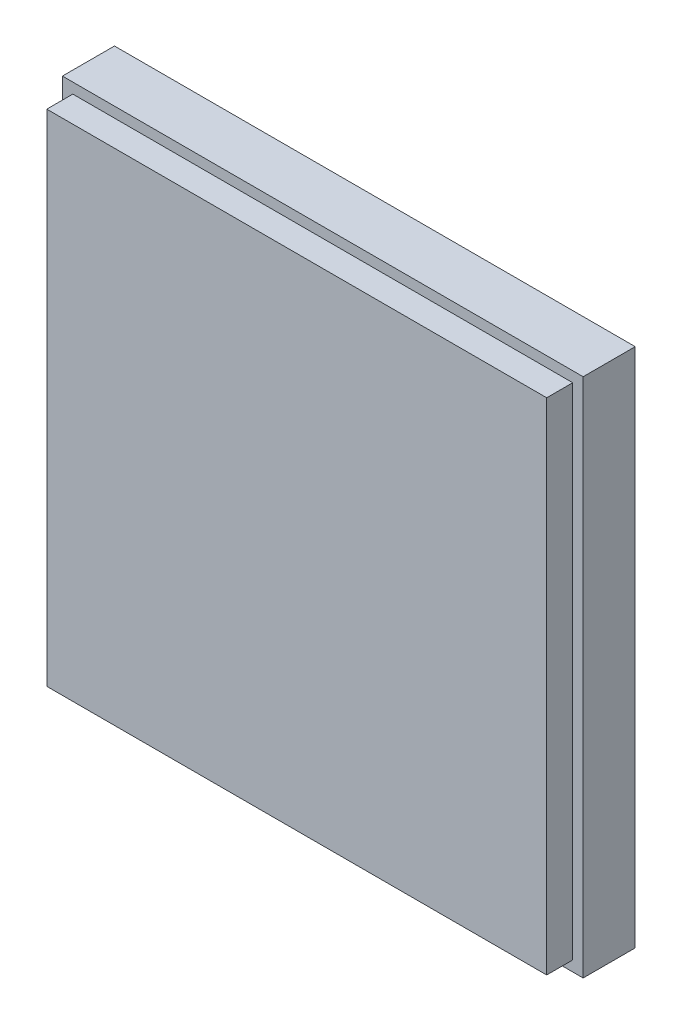
ISO-10303-21;
HEADER;
FILE_DESCRIPTION(('STEP AP214'),'2;1');
FILE_NAME('part.step','',(''),(''),'','','');
FILE_SCHEMA(('AUTOMOTIVE_DESIGN { 1 0 10303 214 1 1 1 1 }'));
ENDSEC;
DATA;
#1=APPLICATION_CONTEXT('core data for automotive mechanical design processes');
#2=APPLICATION_PROTOCOL_DEFINITION('international standard','automotive_design',2000,#1);
#3=PRODUCT_CONTEXT('',#1,'mechanical');
#4=PRODUCT('Part','Part','',(#3));
#5=PRODUCT_RELATED_PRODUCT_CATEGORY('part','',(#4));
#6=PRODUCT_DEFINITION_FORMATION('','',#4);
#7=PRODUCT_DEFINITION_CONTEXT('part definition',#1,'design');
#8=PRODUCT_DEFINITION('design','',#6,#7);
#9=PRODUCT_DEFINITION_SHAPE('','',#8);
#10=(LENGTH_UNIT() NAMED_UNIT(*) SI_UNIT(.MILLI.,.METRE.));
#11=(NAMED_UNIT(*) PLANE_ANGLE_UNIT() SI_UNIT($,.RADIAN.));
#12=(NAMED_UNIT(*) SI_UNIT($,.STERADIAN.) SOLID_ANGLE_UNIT());
#13=UNCERTAINTY_MEASURE_WITH_UNIT(LENGTH_MEASURE(1.E-05),#10,'distance_accuracy_value','');
#14=(GEOMETRIC_REPRESENTATION_CONTEXT(3) GLOBAL_UNCERTAINTY_ASSIGNED_CONTEXT((#13)) GLOBAL_UNIT_ASSIGNED_CONTEXT((#10,
#11,#12)) REPRESENTATION_CONTEXT('',''));
#15=CARTESIAN_POINT('',(0.,0.,0.));
#16=DIRECTION('',(0.,0.,1.));
#17=DIRECTION('',(1.,0.,0.));
#18=AXIS2_PLACEMENT_3D('',#15,#16,#17);
#19=CARTESIAN_POINT('',(-66.0255059306814,18.5238786074807,10.));
#20=DIRECTION('',(1.,0.,0.));
#21=DIRECTION('',(0.,0.,-1.));
#22=AXIS2_PLACEMENT_3D('',#19,#20,#21);
#23=PLANE('',#22);
#24=DIRECTION('',(0.,-1.,0.));
#25=VECTOR('',#24,1.);
#26=CARTESIAN_POINT('',(-66.0255059306814,18.5238786074807,0.));
#27=LINE('',#26,#25);
#28=CARTESIAN_POINT('',(-66.0255059306814,18.5238786074807,0.));
#29=VERTEX_POINT('',#28);
#30=CARTESIAN_POINT('',(-66.0255059306814,-81.4761213925193,0.));
#31=VERTEX_POINT('',#30);
#32=EDGE_CURVE('E118',#29,#31,#27,.T.);
#33=ORIENTED_EDGE('',*,*,#32,.T.);
#34=DIRECTION('',(0.,0.,-1.));
#35=VECTOR('',#34,1.);
#36=CARTESIAN_POINT('',(-66.0255059306814,-81.4761213925193,10.));
#37=LINE('',#36,#35);
#38=CARTESIAN_POINT('',(-66.0255059306814,-81.4761213925193,10.));
#39=VERTEX_POINT('',#38);
#40=EDGE_CURVE('E11',#39,#31,#37,.T.);
#41=ORIENTED_EDGE('',*,*,#40,.F.);
#42=DIRECTION('',(0.,-1.,0.));
#43=VECTOR('',#42,1.);
#44=CARTESIAN_POINT('',(-66.0255059306814,18.5238786074807,10.));
#45=LINE('',#44,#43);
#46=CARTESIAN_POINT('',(-66.0255059306814,18.5238786074807,10.));
#47=VERTEX_POINT('',#46);
#48=EDGE_CURVE('E127',#47,#39,#45,.T.);
#49=ORIENTED_EDGE('',*,*,#48,.F.);
#50=DIRECTION('',(0.,0.,-1.));
#51=VECTOR('',#50,1.);
#52=CARTESIAN_POINT('',(-66.0255059306814,18.5238786074807,10.));
#53=LINE('',#52,#51);
#54=EDGE_CURVE('E136',#47,#29,#53,.T.);
#55=ORIENTED_EDGE('',*,*,#54,.T.);
#56=EDGE_LOOP('',(#33,#41,#49,#55));
#57=FACE_BOUND('',#56,.T.);
#58=ADVANCED_FACE('F33',(#57),#23,.F.);
#59=CARTESIAN_POINT('',(-66.0255059306814,-81.4761213925193,10.));
#60=DIRECTION('',(0.,1.,0.));
#61=DIRECTION('',(0.,0.,1.));
#62=AXIS2_PLACEMENT_3D('',#59,#60,#61);
#63=PLANE('',#62);
#64=DIRECTION('',(1.,0.,0.));
#65=VECTOR('',#64,1.);
#66=CARTESIAN_POINT('',(-66.0255059306814,-81.4761213925193,0.));
#67=LINE('',#66,#65);
#68=CARTESIAN_POINT('',(33.9744940693186,-81.4761213925193,0.));
#69=VERTEX_POINT('',#68);
#70=EDGE_CURVE('E121',#31,#69,#67,.T.);
#71=ORIENTED_EDGE('',*,*,#70,.T.);
#72=DIRECTION('',(0.,0.,-1.));
#73=VECTOR('',#72,1.);
#74=CARTESIAN_POINT('',(33.9744940693186,-81.4761213925193,10.));
#75=LINE('',#74,#73);
#76=CARTESIAN_POINT('',(33.9744940693186,-81.4761213925193,10.));
#77=VERTEX_POINT('',#76);
#78=EDGE_CURVE('E40',#77,#69,#75,.T.);
#79=ORIENTED_EDGE('',*,*,#78,.F.);
#80=DIRECTION('',(1.,0.,0.));
#81=VECTOR('',#80,1.);
#82=CARTESIAN_POINT('',(-66.0255059306814,-81.4761213925193,10.));
#83=LINE('',#82,#81);
#84=EDGE_CURVE('E130',#39,#77,#83,.T.);
#85=ORIENTED_EDGE('',*,*,#84,.F.);
#86=ORIENTED_EDGE('',*,*,#40,.T.);
#87=EDGE_LOOP('',(#71,#79,#85,#86));
#88=FACE_BOUND('',#87,.T.);
#89=ADVANCED_FACE('F167',(#88),#63,.F.);
#90=CARTESIAN_POINT('',(33.9744940693186,18.5238786074807,10.));
#91=DIRECTION('',(-1.,0.,0.));
#92=DIRECTION('',(0.,-1.,0.));
#93=AXIS2_PLACEMENT_3D('',#90,#91,#92);
#94=PLANE('',#93);
#95=DIRECTION('',(0.,1.,0.));
#96=VECTOR('',#95,1.);
#97=CARTESIAN_POINT('',(33.9744940693186,18.5238786074807,0.));
#98=LINE('',#97,#96);
#99=CARTESIAN_POINT('',(33.9744940693186,18.5238786074807,0.));
#100=VERTEX_POINT('',#99);
#101=EDGE_CURVE('E139',#69,#100,#98,.T.);
#102=ORIENTED_EDGE('',*,*,#101,.T.);
#103=DIRECTION('',(0.,0.,-1.));
#104=VECTOR('',#103,1.);
#105=CARTESIAN_POINT('',(33.9744940693186,18.5238786074807,10.));
#106=LINE('',#105,#104);
#107=CARTESIAN_POINT('',(33.9744940693186,18.5238786074807,10.));
#108=VERTEX_POINT('',#107);
#109=EDGE_CURVE('E144',#108,#100,#106,.T.);
#110=ORIENTED_EDGE('',*,*,#109,.F.);
#111=DIRECTION('',(0.,1.,0.));
#112=VECTOR('',#111,1.);
#113=CARTESIAN_POINT('',(33.9744940693186,18.5238786074807,10.));
#114=LINE('',#113,#112);
#115=EDGE_CURVE('E133',#77,#108,#114,.T.);
#116=ORIENTED_EDGE('',*,*,#115,.F.);
#117=ORIENTED_EDGE('',*,*,#78,.T.);
#118=EDGE_LOOP('',(#102,#110,#116,#117));
#119=FACE_BOUND('',#118,.T.);
#120=ADVANCED_FACE('F151',(#119),#94,.F.);
#121=CARTESIAN_POINT('',(-66.0255059306814,18.5238786074807,10.));
#122=DIRECTION('',(0.,-1.,0.));
#123=DIRECTION('',(0.,0.,-1.));
#124=AXIS2_PLACEMENT_3D('',#121,#122,#123);
#125=PLANE('',#124);
#126=DIRECTION('',(-1.,0.,0.));
#127=VECTOR('',#126,1.);
#128=CARTESIAN_POINT('',(-66.0255059306814,18.5238786074807,0.));
#129=LINE('',#128,#127);
#130=EDGE_CURVE('E131',#100,#29,#129,.T.);
#131=ORIENTED_EDGE('',*,*,#130,.T.);
#132=ORIENTED_EDGE('',*,*,#54,.F.);
#133=DIRECTION('',(-1.,0.,0.));
#134=VECTOR('',#133,1.);
#135=CARTESIAN_POINT('',(-66.0255059306814,18.5238786074807,10.));
#136=LINE('',#135,#134);
#137=EDGE_CURVE('E135',#108,#47,#136,.T.);
#138=ORIENTED_EDGE('',*,*,#137,.F.);
#139=ORIENTED_EDGE('',*,*,#109,.T.);
#140=EDGE_LOOP('',(#131,#132,#138,#139));
#141=FACE_BOUND('',#140,.T.);
#142=ADVANCED_FACE('F160',(#141),#125,.F.);
#143=CARTESIAN_POINT('',(0.,0.,10.));
#144=DIRECTION('',(0.,0.,1.));
#145=DIRECTION('',(1.,0.,0.));
#146=AXIS2_PLACEMENT_3D('',#143,#144,#145);
#147=PLANE('',#146);
#148=DIRECTION('',(0.,-1.,0.));
#149=VECTOR('',#148,1.);
#150=CARTESIAN_POINT('',(-64.0255059306814,16.5238786074807,10.));
#151=LINE('',#150,#149);
#152=CARTESIAN_POINT('',(-64.0255059306814,16.5238786074807,10.));
#153=VERTEX_POINT('',#152);
#154=CARTESIAN_POINT('',(-64.0255059306814,-79.4761213925193,10.));
#155=VERTEX_POINT('',#154);
#156=EDGE_CURVE('E47',#153,#155,#151,.T.);
#157=ORIENTED_EDGE('',*,*,#156,.F.);
#158=DIRECTION('',(1.,0.,0.));
#159=VECTOR('',#158,1.);
#160=CARTESIAN_POINT('',(-64.0255059306814,16.5238786074807,10.));
#161=LINE('',#160,#159);
#162=CARTESIAN_POINT('',(31.9744940693186,16.5238786074807,10.));
#163=VERTEX_POINT('',#162);
#164=EDGE_CURVE('E52',#153,#163,#161,.T.);
#165=ORIENTED_EDGE('',*,*,#164,.T.);
#166=DIRECTION('',(0.,-1.,0.));
#167=VECTOR('',#166,1.);
#168=CARTESIAN_POINT('',(31.9744940693186,16.5238786074807,10.));
#169=LINE('',#168,#167);
#170=CARTESIAN_POINT('',(31.9744940693186,-79.4761213925193,10.));
#171=VERTEX_POINT('',#170);
#172=EDGE_CURVE('E260',#163,#171,#169,.T.);
#173=ORIENTED_EDGE('',*,*,#172,.T.);
#174=DIRECTION('',(1.,0.,0.));
#175=VECTOR('',#174,1.);
#176=CARTESIAN_POINT('',(-64.0255059306814,-79.4761213925193,10.));
#177=LINE('',#176,#175);
#178=EDGE_CURVE('E262',#155,#171,#177,.T.);
#179=ORIENTED_EDGE('',*,*,#178,.F.);
#180=EDGE_LOOP('',(#157,#165,#173,#179));
#181=FACE_BOUND('',#180,.T.);
#182=ORIENTED_EDGE('',*,*,#48,.T.);
#183=ORIENTED_EDGE('',*,*,#84,.T.);
#184=ORIENTED_EDGE('',*,*,#115,.T.);
#185=ORIENTED_EDGE('',*,*,#137,.T.);
#186=EDGE_LOOP('',(#182,#183,#184,#185));
#187=FACE_BOUND('',#186,.T.);
#188=ADVANCED_FACE('F166',(#181,#187),#147,.T.);
#189=CARTESIAN_POINT('',(0.,0.,0.));
#190=DIRECTION('',(0.,0.,1.));
#191=DIRECTION('',(1.,0.,0.));
#192=AXIS2_PLACEMENT_3D('',#189,#190,#191);
#193=PLANE('',#192);
#194=ORIENTED_EDGE('',*,*,#32,.F.);
#195=ORIENTED_EDGE('',*,*,#130,.F.);
#196=ORIENTED_EDGE('',*,*,#101,.F.);
#197=ORIENTED_EDGE('',*,*,#70,.F.);
#198=EDGE_LOOP('',(#194,#195,#196,#197));
#199=FACE_BOUND('',#198,.T.);
#200=ADVANCED_FACE('F157',(#199),#193,.F.);
#201=CARTESIAN_POINT('',(-64.0255059306814,16.5238786074807,15.));
#202=DIRECTION('',(1.,0.,0.));
#203=DIRECTION('',(0.,1.,0.));
#204=AXIS2_PLACEMENT_3D('',#201,#202,#203);
#205=PLANE('',#204);
#206=ORIENTED_EDGE('',*,*,#156,.T.);
#207=DIRECTION('',(0.,0.,-1.));
#208=VECTOR('',#207,1.);
#209=CARTESIAN_POINT('',(-64.0255059306814,-79.4761213925193,15.));
#210=LINE('',#209,#208);
#211=CARTESIAN_POINT('',(-64.0255059306814,-79.4761213925193,15.));
#212=VERTEX_POINT('',#211);
#213=EDGE_CURVE('E101',#212,#155,#210,.T.);
#214=ORIENTED_EDGE('',*,*,#213,.F.);
#215=DIRECTION('',(0.,-1.,0.));
#216=VECTOR('',#215,1.);
#217=CARTESIAN_POINT('',(-64.0255059306814,16.5238786074807,15.));
#218=LINE('',#217,#216);
#219=CARTESIAN_POINT('',(-64.0255059306814,16.5238786074807,15.));
#220=VERTEX_POINT('',#219);
#221=EDGE_CURVE('E108',#220,#212,#218,.T.);
#222=ORIENTED_EDGE('',*,*,#221,.F.);
#223=DIRECTION('',(0.,0.,-1.));
#224=VECTOR('',#223,1.);
#225=CARTESIAN_POINT('',(-64.0255059306814,16.5238786074807,15.));
#226=LINE('',#225,#224);
#227=EDGE_CURVE('E258',#220,#153,#226,.T.);
#228=ORIENTED_EDGE('',*,*,#227,.T.);
#229=EDGE_LOOP('',(#206,#214,#222,#228));
#230=FACE_BOUND('',#229,.T.);
#231=ADVANCED_FACE('F117',(#230),#205,.F.);
#232=CARTESIAN_POINT('',(-64.0255059306814,-79.4761213925193,15.));
#233=DIRECTION('',(0.,1.,0.));
#234=DIRECTION('',(0.,0.,1.));
#235=AXIS2_PLACEMENT_3D('',#232,#233,#234);
#236=PLANE('',#235);
#237=ORIENTED_EDGE('',*,*,#178,.T.);
#238=DIRECTION('',(0.,0.,-1.));
#239=VECTOR('',#238,1.);
#240=CARTESIAN_POINT('',(31.9744940693186,-79.4761213925193,15.));
#241=LINE('',#240,#239);
#242=CARTESIAN_POINT('',(31.9744940693186,-79.4761213925193,15.));
#243=VERTEX_POINT('',#242);
#244=EDGE_CURVE('E103',#243,#171,#241,.T.);
#245=ORIENTED_EDGE('',*,*,#244,.F.);
#246=DIRECTION('',(1.,0.,0.));
#247=VECTOR('',#246,1.);
#248=CARTESIAN_POINT('',(-64.0255059306814,-79.4761213925193,15.));
#249=LINE('',#248,#247);
#250=EDGE_CURVE('E96',#212,#243,#249,.T.);
#251=ORIENTED_EDGE('',*,*,#250,.F.);
#252=ORIENTED_EDGE('',*,*,#213,.T.);
#253=EDGE_LOOP('',(#237,#245,#251,#252));
#254=FACE_BOUND('',#253,.T.);
#255=ADVANCED_FACE('F99',(#254),#236,.F.);
#256=CARTESIAN_POINT('',(31.9744940693186,16.5238786074807,15.));
#257=DIRECTION('',(1.,0.,0.));
#258=DIRECTION('',(0.,1.,0.));
#259=AXIS2_PLACEMENT_3D('',#256,#257,#258);
#260=PLANE('',#259);
#261=ORIENTED_EDGE('',*,*,#172,.F.);
#262=DIRECTION('',(0.,0.,-1.));
#263=VECTOR('',#262,1.);
#264=CARTESIAN_POINT('',(31.9744940693186,16.5238786074807,15.));
#265=LINE('',#264,#263);
#266=CARTESIAN_POINT('',(31.9744940693186,16.5238786074807,15.));
#267=VERTEX_POINT('',#266);
#268=EDGE_CURVE('E123',#267,#163,#265,.T.);
#269=ORIENTED_EDGE('',*,*,#268,.F.);
#270=DIRECTION('',(0.,-1.,0.));
#271=VECTOR('',#270,1.);
#272=CARTESIAN_POINT('',(31.9744940693186,16.5238786074807,15.));
#273=LINE('',#272,#271);
#274=EDGE_CURVE('E107',#267,#243,#273,.T.);
#275=ORIENTED_EDGE('',*,*,#274,.T.);
#276=ORIENTED_EDGE('',*,*,#244,.T.);
#277=EDGE_LOOP('',(#261,#269,#275,#276));
#278=FACE_BOUND('',#277,.T.);
#279=ADVANCED_FACE('F185',(#278),#260,.T.);
#280=CARTESIAN_POINT('',(-64.0255059306814,16.5238786074807,15.));
#281=DIRECTION('',(0.,1.,0.));
#282=DIRECTION('',(0.,0.,1.));
#283=AXIS2_PLACEMENT_3D('',#280,#281,#282);
#284=PLANE('',#283);
#285=ORIENTED_EDGE('',*,*,#164,.F.);
#286=ORIENTED_EDGE('',*,*,#227,.F.);
#287=DIRECTION('',(1.,0.,0.));
#288=VECTOR('',#287,1.);
#289=CARTESIAN_POINT('',(-64.0255059306814,16.5238786074807,15.));
#290=LINE('',#289,#288);
#291=EDGE_CURVE('E114',#220,#267,#290,.T.);
#292=ORIENTED_EDGE('',*,*,#291,.T.);
#293=ORIENTED_EDGE('',*,*,#268,.T.);
#294=EDGE_LOOP('',(#285,#286,#292,#293));
#295=FACE_BOUND('',#294,.T.);
#296=ADVANCED_FACE('F188',(#295),#284,.T.);
#297=CARTESIAN_POINT('',(0.,0.,15.));
#298=DIRECTION('',(0.,0.,1.));
#299=DIRECTION('',(1.,0.,0.));
#300=AXIS2_PLACEMENT_3D('',#297,#298,#299);
#301=PLANE('',#300);
#302=ORIENTED_EDGE('',*,*,#221,.T.);
#303=ORIENTED_EDGE('',*,*,#250,.T.);
#304=ORIENTED_EDGE('',*,*,#274,.F.);
#305=ORIENTED_EDGE('',*,*,#291,.F.);
#306=EDGE_LOOP('',(#302,#303,#304,#305));
#307=FACE_BOUND('',#306,.T.);
#308=ADVANCED_FACE('F112',(#307),#301,.T.);
#309=CLOSED_SHELL('',(#58,#89,#120,#142,#188,#200,#231,#255,#279,#296,#308));
#310=MANIFOLD_SOLID_BREP('B2',#309);
#311=ADVANCED_BREP_SHAPE_REPRESENTATION('',(#18,#310),#14);
#312=SHAPE_DEFINITION_REPRESENTATION(#9,#311);
ENDSEC;
END-ISO-10303-21;
